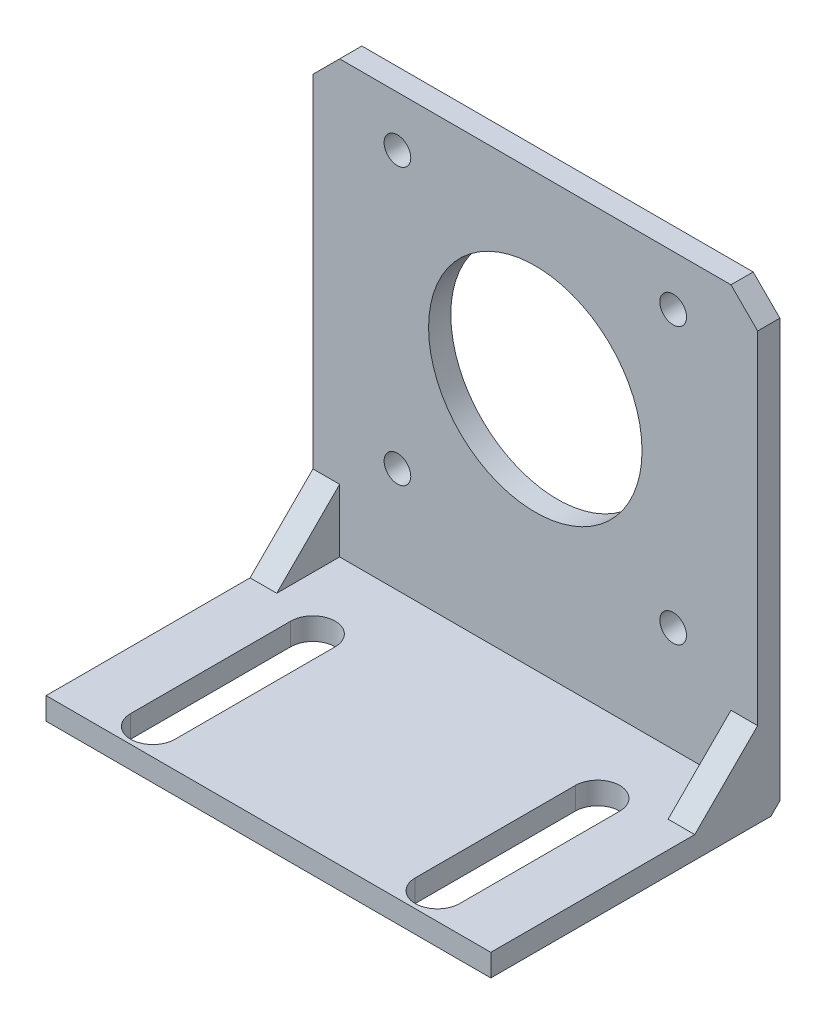
ISO-10303-21;
HEADER;
FILE_DESCRIPTION(('STEP AP214'),'2;1');
FILE_NAME('part.step','',(''),(''),'','','');
FILE_SCHEMA(('AUTOMOTIVE_DESIGN { 1 0 10303 214 1 1 1 1 }'));
ENDSEC;
DATA;
#1=APPLICATION_CONTEXT('core data for automotive mechanical design processes');
#2=APPLICATION_PROTOCOL_DEFINITION('international standard','automotive_design',2000,#1);
#3=PRODUCT_CONTEXT('',#1,'mechanical');
#4=PRODUCT('Part','Part','',(#3));
#5=PRODUCT_RELATED_PRODUCT_CATEGORY('part','',(#4));
#6=PRODUCT_DEFINITION_FORMATION('','',#4);
#7=PRODUCT_DEFINITION_CONTEXT('part definition',#1,'design');
#8=PRODUCT_DEFINITION('design','',#6,#7);
#9=PRODUCT_DEFINITION_SHAPE('','',#8);
#10=(LENGTH_UNIT() NAMED_UNIT(*) SI_UNIT(.MILLI.,.METRE.));
#11=(NAMED_UNIT(*) PLANE_ANGLE_UNIT() SI_UNIT($,.RADIAN.));
#12=(NAMED_UNIT(*) SI_UNIT($,.STERADIAN.) SOLID_ANGLE_UNIT());
#13=UNCERTAINTY_MEASURE_WITH_UNIT(LENGTH_MEASURE(1.E-05),#10,'distance_accuracy_value','');
#14=(GEOMETRIC_REPRESENTATION_CONTEXT(3) GLOBAL_UNCERTAINTY_ASSIGNED_CONTEXT((#13)) GLOBAL_UNIT_ASSIGNED_CONTEXT((#10,
#11,#12)) REPRESENTATION_CONTEXT('',''));
#15=CARTESIAN_POINT('',(0.,0.,0.));
#16=DIRECTION('',(0.,0.,1.));
#17=DIRECTION('',(1.,0.,0.));
#18=AXIS2_PLACEMENT_3D('',#15,#16,#17);
#19=CARTESIAN_POINT('',(0.,0.,2.5));
#20=DIRECTION('',(0.,0.,1.));
#21=DIRECTION('',(1.,0.,0.));
#22=AXIS2_PLACEMENT_3D('',#19,#20,#21);
#23=PLANE('',#22);
#24=CARTESIAN_POINT('',(15.5,-15.5,2.5));
#25=DIRECTION('',(0.,0.,1.));
#26=DIRECTION('',(1.,0.,0.));
#27=AXIS2_PLACEMENT_3D('',#24,#25,#26);
#28=CIRCLE('',#27,1.5);
#29=CARTESIAN_POINT('',(17.,-15.5,2.5));
#30=VERTEX_POINT('',#29);
#31=EDGE_CURVE('E353',#30,#30,#28,.T.);
#32=ORIENTED_EDGE('',*,*,#31,.F.);
#33=EDGE_LOOP('',(#32));
#34=FACE_BOUND('',#33,.T.);
#35=CARTESIAN_POINT('',(15.5,15.5,2.5));
#36=DIRECTION('',(0.,0.,1.));
#37=DIRECTION('',(1.,0.,0.));
#38=AXIS2_PLACEMENT_3D('',#35,#36,#37);
#39=CIRCLE('',#38,1.5);
#40=CARTESIAN_POINT('',(17.,15.5,2.5));
#41=VERTEX_POINT('',#40);
#42=EDGE_CURVE('E357',#41,#41,#39,.F.);
#43=ORIENTED_EDGE('',*,*,#42,.T.);
#44=EDGE_LOOP('',(#43));
#45=FACE_BOUND('',#44,.T.);
#46=CARTESIAN_POINT('',(-15.5,15.5,2.5));
#47=DIRECTION('',(0.,0.,1.));
#48=DIRECTION('',(1.,0.,0.));
#49=AXIS2_PLACEMENT_3D('',#46,#47,#48);
#50=CIRCLE('',#49,1.5);
#51=CARTESIAN_POINT('',(-14.,15.5,2.5));
#52=VERTEX_POINT('',#51);
#53=EDGE_CURVE('E362',#52,#52,#50,.T.);
#54=ORIENTED_EDGE('',*,*,#53,.F.);
#55=EDGE_LOOP('',(#54));
#56=FACE_BOUND('',#55,.T.);
#57=CARTESIAN_POINT('',(0.,0.,2.5));
#58=DIRECTION('',(0.,0.,1.));
#59=DIRECTION('',(1.,0.,0.));
#60=AXIS2_PLACEMENT_3D('',#57,#58,#59);
#61=CIRCLE('',#60,12.);
#62=CARTESIAN_POINT('',(12.,0.,2.5));
#63=VERTEX_POINT('',#62);
#64=EDGE_CURVE('E366',#63,#63,#61,.T.);
#65=ORIENTED_EDGE('',*,*,#64,.F.);
#66=EDGE_LOOP('',(#65));
#67=FACE_BOUND('',#66,.T.);
#68=CARTESIAN_POINT('',(-15.5,-15.5,2.5));
#69=DIRECTION('',(0.,0.,1.));
#70=DIRECTION('',(1.,0.,0.));
#71=AXIS2_PLACEMENT_3D('',#68,#69,#70);
#72=CIRCLE('',#71,1.5);
#73=CARTESIAN_POINT('',(-14.,-15.5,2.5));
#74=VERTEX_POINT('',#73);
#75=EDGE_CURVE('E390',#74,#74,#72,.F.);
#76=ORIENTED_EDGE('',*,*,#75,.T.);
#77=EDGE_LOOP('',(#76));
#78=FACE_BOUND('',#77,.T.);
#79=DIRECTION('',(0.,-1.,0.));
#80=VECTOR('',#79,1.);
#81=CARTESIAN_POINT('',(-25.,0.,2.5));
#82=LINE('',#81,#80);
#83=CARTESIAN_POINT('',(-25.,18.15,2.5));
#84=VERTEX_POINT('',#83);
#85=CARTESIAN_POINT('',(-25.,-20.2789321881346,2.5));
#86=VERTEX_POINT('',#85);
#87=EDGE_CURVE('E386',#84,#86,#82,.T.);
#88=ORIENTED_EDGE('',*,*,#87,.T.);
#89=DIRECTION('',(-1.,0.,0.));
#90=VECTOR('',#89,1.);
#91=CARTESIAN_POINT('',(-22.,-20.2789321881346,2.5));
#92=LINE('',#91,#90);
#93=CARTESIAN_POINT('',(-22.,-20.2789321881346,2.5));
#94=VERTEX_POINT('',#93);
#95=EDGE_CURVE('E202',#94,#86,#92,.T.);
#96=ORIENTED_EDGE('',*,*,#95,.F.);
#97=DIRECTION('',(0.,1.,0.));
#98=VECTOR('',#97,1.);
#99=CARTESIAN_POINT('',(-22.,-27.35,2.5));
#100=LINE('',#99,#98);
#101=CARTESIAN_POINT('',(-22.,-27.35,2.5));
#102=VERTEX_POINT('',#101);
#103=EDGE_CURVE('E188',#102,#94,#100,.T.);
#104=ORIENTED_EDGE('',*,*,#103,.F.);
#105=DIRECTION('',(-1.,0.,0.));
#106=VECTOR('',#105,1.);
#107=CARTESIAN_POINT('',(-25.,-27.35,2.5));
#108=LINE('',#107,#106);
#109=CARTESIAN_POINT('',(22.,-27.35,2.5));
#110=VERTEX_POINT('',#109);
#111=EDGE_CURVE('E207',#110,#102,#108,.T.);
#112=ORIENTED_EDGE('',*,*,#111,.F.);
#113=DIRECTION('',(0.,1.,0.));
#114=VECTOR('',#113,1.);
#115=CARTESIAN_POINT('',(22.,-27.35,2.5));
#116=LINE('',#115,#114);
#117=CARTESIAN_POINT('',(22.,-20.2789321881346,2.5));
#118=VERTEX_POINT('',#117);
#119=EDGE_CURVE('E221',#110,#118,#116,.T.);
#120=ORIENTED_EDGE('',*,*,#119,.T.);
#121=DIRECTION('',(1.,0.,0.));
#122=VECTOR('',#121,1.);
#123=CARTESIAN_POINT('',(22.,-20.2789321881346,2.5));
#124=LINE('',#123,#122);
#125=CARTESIAN_POINT('',(25.,-20.2789321881346,2.5));
#126=VERTEX_POINT('',#125);
#127=EDGE_CURVE('E228',#118,#126,#124,.T.);
#128=ORIENTED_EDGE('',*,*,#127,.T.);
#129=DIRECTION('',(0.,-1.,0.));
#130=VECTOR('',#129,1.);
#131=CARTESIAN_POINT('',(25.,0.,2.5));
#132=LINE('',#131,#130);
#133=CARTESIAN_POINT('',(25.,18.15,2.5));
#134=VERTEX_POINT('',#133);
#135=EDGE_CURVE('E370',#134,#126,#132,.T.);
#136=ORIENTED_EDGE('',*,*,#135,.F.);
#137=DIRECTION('',(-0.707106781186548,0.707106781186548,0.));
#138=VECTOR('',#137,1.);
#139=CARTESIAN_POINT('',(21.575,21.575,2.5));
#140=LINE('',#139,#138);
#141=CARTESIAN_POINT('',(22.,21.15,2.5));
#142=VERTEX_POINT('',#141);
#143=EDGE_CURVE('E374',#134,#142,#140,.T.);
#144=ORIENTED_EDGE('',*,*,#143,.T.);
#145=DIRECTION('',(-1.,0.,0.));
#146=VECTOR('',#145,1.);
#147=CARTESIAN_POINT('',(0.,21.15,2.5));
#148=LINE('',#147,#146);
#149=CARTESIAN_POINT('',(-22.,21.15,2.5));
#150=VERTEX_POINT('',#149);
#151=EDGE_CURVE('E378',#142,#150,#148,.T.);
#152=ORIENTED_EDGE('',*,*,#151,.T.);
#153=DIRECTION('',(-0.707106781186548,-0.707106781186548,0.));
#154=VECTOR('',#153,1.);
#155=CARTESIAN_POINT('',(-21.575,21.575,2.5));
#156=LINE('',#155,#154);
#157=EDGE_CURVE('E382',#150,#84,#156,.T.);
#158=ORIENTED_EDGE('',*,*,#157,.T.);
#159=EDGE_LOOP('',(#88,#96,#104,#112,#120,#128,#136,#144,#152,#158));
#160=FACE_BOUND('',#159,.T.);
#161=ADVANCED_FACE('F41',(#34,#45,#56,#67,#78,#160),#23,.T.);
#162=CARTESIAN_POINT('',(-25.,-27.35,32.5));
#163=DIRECTION('',(0.,-1.,0.));
#164=DIRECTION('',(0.,0.,-1.));
#165=AXIS2_PLACEMENT_3D('',#162,#163,#164);
#166=PLANE('',#165);
#167=DIRECTION('',(0.,0.,1.));
#168=VECTOR('',#167,1.);
#169=CARTESIAN_POINT('',(-18.5,-27.35,0.));
#170=LINE('',#169,#168);
#171=CARTESIAN_POINT('',(-18.5,-27.35,11.5));
#172=VERTEX_POINT('',#171);
#173=CARTESIAN_POINT('',(-18.5,-27.35,29.5));
#174=VERTEX_POINT('',#173);
#175=EDGE_CURVE('E302',#172,#174,#170,.T.);
#176=ORIENTED_EDGE('',*,*,#175,.F.);
#177=CARTESIAN_POINT('',(-16.,-27.35,11.5));
#178=DIRECTION('',(0.,1.,0.));
#179=DIRECTION('',(0.,0.,1.));
#180=AXIS2_PLACEMENT_3D('',#177,#178,#179);
#181=CIRCLE('',#180,2.5);
#182=CARTESIAN_POINT('',(-13.5,-27.35,11.5));
#183=VERTEX_POINT('',#182);
#184=EDGE_CURVE('E236',#183,#172,#181,.T.);
#185=ORIENTED_EDGE('',*,*,#184,.F.);
#186=DIRECTION('',(0.,0.,1.));
#187=VECTOR('',#186,1.);
#188=CARTESIAN_POINT('',(-13.5,-27.35,0.));
#189=LINE('',#188,#187);
#190=CARTESIAN_POINT('',(-13.5,-27.35,29.5));
#191=VERTEX_POINT('',#190);
#192=EDGE_CURVE('E288',#183,#191,#189,.T.);
#193=ORIENTED_EDGE('',*,*,#192,.T.);
#194=CARTESIAN_POINT('',(-16.,-27.35,29.5));
#195=DIRECTION('',(0.,1.,0.));
#196=DIRECTION('',(0.,0.,1.));
#197=AXIS2_PLACEMENT_3D('',#194,#195,#196);
#198=CIRCLE('',#197,2.5);
#199=EDGE_CURVE('E306',#191,#174,#198,.F.);
#200=ORIENTED_EDGE('',*,*,#199,.T.);
#201=EDGE_LOOP('',(#176,#185,#193,#200));
#202=FACE_BOUND('',#201,.T.);
#203=DIRECTION('',(0.,0.,1.));
#204=VECTOR('',#203,1.);
#205=CARTESIAN_POINT('',(18.5,-27.35,0.));
#206=LINE('',#205,#204);
#207=CARTESIAN_POINT('',(18.5,-27.35,11.5));
#208=VERTEX_POINT('',#207);
#209=CARTESIAN_POINT('',(18.5,-27.35,29.5));
#210=VERTEX_POINT('',#209);
#211=EDGE_CURVE('E259',#208,#210,#206,.T.);
#212=ORIENTED_EDGE('',*,*,#211,.T.);
#213=CARTESIAN_POINT('',(16.,-27.35,29.5));
#214=DIRECTION('',(0.,1.,0.));
#215=DIRECTION('',(0.,0.,1.));
#216=AXIS2_PLACEMENT_3D('',#213,#214,#215);
#217=CIRCLE('',#216,2.5);
#218=CARTESIAN_POINT('',(13.5,-27.35,29.5));
#219=VERTEX_POINT('',#218);
#220=EDGE_CURVE('E256',#219,#210,#217,.T.);
#221=ORIENTED_EDGE('',*,*,#220,.F.);
#222=DIRECTION('',(0.,0.,1.));
#223=VECTOR('',#222,1.);
#224=CARTESIAN_POINT('',(13.5,-27.35,0.));
#225=LINE('',#224,#223);
#226=CARTESIAN_POINT('',(13.5,-27.35,11.5));
#227=VERTEX_POINT('',#226);
#228=EDGE_CURVE('E244',#227,#219,#225,.T.);
#229=ORIENTED_EDGE('',*,*,#228,.F.);
#230=CARTESIAN_POINT('',(16.,-27.35,11.5));
#231=DIRECTION('',(0.,1.,0.));
#232=DIRECTION('',(0.,0.,1.));
#233=AXIS2_PLACEMENT_3D('',#230,#231,#232);
#234=CIRCLE('',#233,2.5);
#235=EDGE_CURVE('E264',#208,#227,#234,.T.);
#236=ORIENTED_EDGE('',*,*,#235,.F.);
#237=EDGE_LOOP('',(#212,#221,#229,#236));
#238=FACE_BOUND('',#237,.T.);
#239=DIRECTION('',(-1.,0.,0.));
#240=VECTOR('',#239,1.);
#241=CARTESIAN_POINT('',(-22.,-27.35,9.57106781186551));
#242=LINE('',#241,#240);
#243=CARTESIAN_POINT('',(-22.,-27.35,9.57106781186551));
#244=VERTEX_POINT('',#243);
#245=CARTESIAN_POINT('',(-25.,-27.35,9.57106781186551));
#246=VERTEX_POINT('',#245);
#247=EDGE_CURVE('E194',#244,#246,#242,.T.);
#248=ORIENTED_EDGE('',*,*,#247,.T.);
#249=DIRECTION('',(0.,0.,-1.));
#250=VECTOR('',#249,1.);
#251=CARTESIAN_POINT('',(-25.,-27.35,32.5));
#252=LINE('',#251,#250);
#253=CARTESIAN_POINT('',(-25.,-27.35,32.5));
#254=VERTEX_POINT('',#253);
#255=EDGE_CURVE('E338',#254,#246,#252,.T.);
#256=ORIENTED_EDGE('',*,*,#255,.F.);
#257=DIRECTION('',(-1.,0.,0.));
#258=VECTOR('',#257,1.);
#259=CARTESIAN_POINT('',(-25.,-27.35,32.5));
#260=LINE('',#259,#258);
#261=CARTESIAN_POINT('',(25.,-27.35,32.5));
#262=VERTEX_POINT('',#261);
#263=EDGE_CURVE('E335',#262,#254,#260,.T.);
#264=ORIENTED_EDGE('',*,*,#263,.F.);
#265=DIRECTION('',(0.,0.,-1.));
#266=VECTOR('',#265,1.);
#267=CARTESIAN_POINT('',(25.,-27.35,32.5));
#268=LINE('',#267,#266);
#269=CARTESIAN_POINT('',(25.,-27.35,9.57106781186551));
#270=VERTEX_POINT('',#269);
#271=EDGE_CURVE('E343',#262,#270,#268,.T.);
#272=ORIENTED_EDGE('',*,*,#271,.T.);
#273=DIRECTION('',(1.,0.,0.));
#274=VECTOR('',#273,1.);
#275=CARTESIAN_POINT('',(22.,-27.35,9.57106781186551));
#276=LINE('',#275,#274);
#277=CARTESIAN_POINT('',(22.,-27.35,9.57106781186551));
#278=VERTEX_POINT('',#277);
#279=EDGE_CURVE('E232',#278,#270,#276,.T.);
#280=ORIENTED_EDGE('',*,*,#279,.F.);
#281=DIRECTION('',(0.,0.,-1.));
#282=VECTOR('',#281,1.);
#283=CARTESIAN_POINT('',(22.,-27.35,9.57106781186551));
#284=LINE('',#283,#282);
#285=EDGE_CURVE('E218',#278,#110,#284,.T.);
#286=ORIENTED_EDGE('',*,*,#285,.T.);
#287=ORIENTED_EDGE('',*,*,#111,.T.);
#288=DIRECTION('',(0.,0.,-1.));
#289=VECTOR('',#288,1.);
#290=CARTESIAN_POINT('',(-22.,-27.35,9.57106781186551));
#291=LINE('',#290,#289);
#292=EDGE_CURVE('E186',#244,#102,#291,.T.);
#293=ORIENTED_EDGE('',*,*,#292,.F.);
#294=EDGE_LOOP('',(#248,#256,#264,#272,#280,#286,#287,#293));
#295=FACE_BOUND('',#294,.T.);
#296=ADVANCED_FACE('F205',(#202,#238,#295),#166,.F.);
#297=CARTESIAN_POINT('',(25.,0.,2.5));
#298=DIRECTION('',(1.,0.,0.));
#299=DIRECTION('',(0.,1.,0.));
#300=AXIS2_PLACEMENT_3D('',#297,#298,#299);
#301=PLANE('',#300);
#302=DIRECTION('',(0.,0.,-1.));
#303=VECTOR('',#302,1.);
#304=CARTESIAN_POINT('',(25.,-29.85,2.5));
#305=LINE('',#304,#303);
#306=CARTESIAN_POINT('',(25.,-29.85,32.5));
#307=VERTEX_POINT('',#306);
#308=CARTESIAN_POINT('',(25.,-29.85,0.999999999999994));
#309=VERTEX_POINT('',#308);
#310=EDGE_CURVE('E346',#307,#309,#305,.T.);
#311=ORIENTED_EDGE('',*,*,#310,.T.);
#312=DIRECTION('',(0.,0.707106781186546,-0.707106781186549));
#313=VECTOR('',#312,1.);
#314=CARTESIAN_POINT('',(25.,-15.6750000000001,-13.175));
#315=LINE('',#314,#313);
#316=CARTESIAN_POINT('',(25.,-28.85,0.));
#317=VERTEX_POINT('',#316);
#318=EDGE_CURVE('E11',#309,#317,#315,.T.);
#319=ORIENTED_EDGE('',*,*,#318,.T.);
#320=DIRECTION('',(0.,-1.,0.));
#321=VECTOR('',#320,1.);
#322=CARTESIAN_POINT('',(25.,0.,0.));
#323=LINE('',#322,#321);
#324=CARTESIAN_POINT('',(25.,18.15,0.));
#325=VERTEX_POINT('',#324);
#326=EDGE_CURVE('E410',#325,#317,#323,.T.);
#327=ORIENTED_EDGE('',*,*,#326,.F.);
#328=DIRECTION('',(0.,0.,-1.));
#329=VECTOR('',#328,1.);
#330=CARTESIAN_POINT('',(25.,18.15,2.5));
#331=LINE('',#330,#329);
#332=EDGE_CURVE('E443',#134,#325,#331,.T.);
#333=ORIENTED_EDGE('',*,*,#332,.F.);
#334=ORIENTED_EDGE('',*,*,#135,.T.);
#335=DIRECTION('',(0.,-0.707106781186544,0.707106781186551));
#336=VECTOR('',#335,1.);
#337=CARTESIAN_POINT('',(25.,-20.2789321881346,2.5));
#338=LINE('',#337,#336);
#339=EDGE_CURVE('E216',#126,#270,#338,.T.);
#340=ORIENTED_EDGE('',*,*,#339,.T.);
#341=ORIENTED_EDGE('',*,*,#271,.F.);
#342=DIRECTION('',(0.,1.,0.));
#343=VECTOR('',#342,1.);
#344=CARTESIAN_POINT('',(25.,-29.85,32.5));
#345=LINE('',#344,#343);
#346=EDGE_CURVE('E332',#307,#262,#345,.T.);
#347=ORIENTED_EDGE('',*,*,#346,.F.);
#348=EDGE_LOOP('',(#311,#319,#327,#333,#334,#340,#341,#347));
#349=FACE_BOUND('',#348,.T.);
#350=ADVANCED_FACE('F473',(#349),#301,.T.);
#351=CARTESIAN_POINT('',(21.575,21.575,2.5));
#352=DIRECTION('',(-0.707106781186548,-0.707106781186548,0.));
#353=DIRECTION('',(0.707106781186548,-0.707106781186548,0.));
#354=AXIS2_PLACEMENT_3D('',#351,#352,#353);
#355=PLANE('',#354);
#356=DIRECTION('',(-0.707106781186548,0.707106781186548,0.));
#357=VECTOR('',#356,1.);
#358=CARTESIAN_POINT('',(21.575,21.575,0.));
#359=LINE('',#358,#357);
#360=CARTESIAN_POINT('',(22.,21.15,0.));
#361=VERTEX_POINT('',#360);
#362=EDGE_CURVE('E414',#325,#361,#359,.T.);
#363=ORIENTED_EDGE('',*,*,#362,.T.);
#364=DIRECTION('',(0.,0.,-1.));
#365=VECTOR('',#364,1.);
#366=CARTESIAN_POINT('',(22.,21.15,2.5));
#367=LINE('',#366,#365);
#368=EDGE_CURVE('E439',#142,#361,#367,.T.);
#369=ORIENTED_EDGE('',*,*,#368,.F.);
#370=ORIENTED_EDGE('',*,*,#143,.F.);
#371=ORIENTED_EDGE('',*,*,#332,.T.);
#372=EDGE_LOOP('',(#363,#369,#370,#371));
#373=FACE_BOUND('',#372,.T.);
#374=ADVANCED_FACE('F470',(#373),#355,.F.);
#375=CARTESIAN_POINT('',(0.,21.15,2.5));
#376=DIRECTION('',(0.,-1.,0.));
#377=DIRECTION('',(1.,0.,0.));
#378=AXIS2_PLACEMENT_3D('',#375,#376,#377);
#379=PLANE('',#378);
#380=DIRECTION('',(-1.,0.,0.));
#381=VECTOR('',#380,1.);
#382=CARTESIAN_POINT('',(0.,21.15,0.));
#383=LINE('',#382,#381);
#384=CARTESIAN_POINT('',(-22.,21.15,0.));
#385=VERTEX_POINT('',#384);
#386=EDGE_CURVE('E418',#361,#385,#383,.T.);
#387=ORIENTED_EDGE('',*,*,#386,.T.);
#388=DIRECTION('',(0.,0.,-1.));
#389=VECTOR('',#388,1.);
#390=CARTESIAN_POINT('',(-22.,21.15,2.5));
#391=LINE('',#390,#389);
#392=EDGE_CURVE('E435',#150,#385,#391,.T.);
#393=ORIENTED_EDGE('',*,*,#392,.F.);
#394=ORIENTED_EDGE('',*,*,#151,.F.);
#395=ORIENTED_EDGE('',*,*,#368,.T.);
#396=EDGE_LOOP('',(#387,#393,#394,#395));
#397=FACE_BOUND('',#396,.T.);
#398=ADVANCED_FACE('F467',(#397),#379,.F.);
#399=CARTESIAN_POINT('',(-21.575,21.575,2.5));
#400=DIRECTION('',(0.707106781186548,-0.707106781186548,0.));
#401=DIRECTION('',(0.707106781186548,0.707106781186548,0.));
#402=AXIS2_PLACEMENT_3D('',#399,#400,#401);
#403=PLANE('',#402);
#404=DIRECTION('',(-0.707106781186548,-0.707106781186548,0.));
#405=VECTOR('',#404,1.);
#406=CARTESIAN_POINT('',(-21.575,21.575,0.));
#407=LINE('',#406,#405);
#408=CARTESIAN_POINT('',(-25.,18.15,0.));
#409=VERTEX_POINT('',#408);
#410=EDGE_CURVE('E422',#385,#409,#407,.T.);
#411=ORIENTED_EDGE('',*,*,#410,.T.);
#412=DIRECTION('',(0.,0.,-1.));
#413=VECTOR('',#412,1.);
#414=CARTESIAN_POINT('',(-25.,18.15,2.5));
#415=LINE('',#414,#413);
#416=EDGE_CURVE('E394',#84,#409,#415,.T.);
#417=ORIENTED_EDGE('',*,*,#416,.F.);
#418=ORIENTED_EDGE('',*,*,#157,.F.);
#419=ORIENTED_EDGE('',*,*,#392,.T.);
#420=EDGE_LOOP('',(#411,#417,#418,#419));
#421=FACE_BOUND('',#420,.T.);
#422=ADVANCED_FACE('F463',(#421),#403,.F.);
#423=CARTESIAN_POINT('',(-25.,0.,2.5));
#424=DIRECTION('',(1.,0.,0.));
#425=DIRECTION('',(0.,1.,0.));
#426=AXIS2_PLACEMENT_3D('',#423,#424,#425);
#427=PLANE('',#426);
#428=DIRECTION('',(0.,-1.,0.));
#429=VECTOR('',#428,1.);
#430=CARTESIAN_POINT('',(-25.,0.,0.));
#431=LINE('',#430,#429);
#432=CARTESIAN_POINT('',(-25.,-28.85,0.));
#433=VERTEX_POINT('',#432);
#434=EDGE_CURVE('E426',#409,#433,#431,.T.);
#435=ORIENTED_EDGE('',*,*,#434,.T.);
#436=DIRECTION('',(0.,-0.707106781186546,0.707106781186549));
#437=VECTOR('',#436,1.);
#438=CARTESIAN_POINT('',(-25.,-28.85,0.));
#439=LINE('',#438,#437);
#440=CARTESIAN_POINT('',(-25.,-29.85,0.999999999999994));
#441=VERTEX_POINT('',#440);
#442=EDGE_CURVE('E64',#433,#441,#439,.T.);
#443=ORIENTED_EDGE('',*,*,#442,.T.);
#444=DIRECTION('',(0.,0.,-1.));
#445=VECTOR('',#444,1.);
#446=CARTESIAN_POINT('',(-25.,-29.85,2.5));
#447=LINE('',#446,#445);
#448=CARTESIAN_POINT('',(-25.,-29.85,32.5));
#449=VERTEX_POINT('',#448);
#450=EDGE_CURVE('E347',#449,#441,#447,.T.);
#451=ORIENTED_EDGE('',*,*,#450,.F.);
#452=DIRECTION('',(0.,-1.,0.));
#453=VECTOR('',#452,1.);
#454=CARTESIAN_POINT('',(-25.,-29.85,32.5));
#455=LINE('',#454,#453);
#456=EDGE_CURVE('E324',#254,#449,#455,.T.);
#457=ORIENTED_EDGE('',*,*,#456,.F.);
#458=ORIENTED_EDGE('',*,*,#255,.T.);
#459=DIRECTION('',(0.,-0.707106781186544,0.707106781186551));
#460=VECTOR('',#459,1.);
#461=CARTESIAN_POINT('',(-25.,-20.2789321881346,2.5));
#462=LINE('',#461,#460);
#463=EDGE_CURVE('E197',#86,#246,#462,.T.);
#464=ORIENTED_EDGE('',*,*,#463,.F.);
#465=ORIENTED_EDGE('',*,*,#87,.F.);
#466=ORIENTED_EDGE('',*,*,#416,.T.);
#467=EDGE_LOOP('',(#435,#443,#451,#457,#458,#464,#465,#466));
#468=FACE_BOUND('',#467,.T.);
#469=ADVANCED_FACE('F460',(#468),#427,.F.);
#470=CARTESIAN_POINT('',(0.,0.,2.5));
#471=DIRECTION('',(0.,0.,-1.));
#472=DIRECTION('',(-1.,0.,0.));
#473=AXIS2_PLACEMENT_3D('',#470,#471,#472);
#474=CYLINDRICAL_SURFACE('',#473,12.);
#475=ORIENTED_EDGE('',*,*,#64,.T.);
#476=EDGE_LOOP('',(#475));
#477=FACE_BOUND('',#476,.T.);
#478=CARTESIAN_POINT('',(0.,0.,0.));
#479=DIRECTION('',(0.,0.,1.));
#480=DIRECTION('',(1.,0.,0.));
#481=AXIS2_PLACEMENT_3D('',#478,#479,#480);
#482=CIRCLE('',#481,12.);
#483=CARTESIAN_POINT('',(12.,0.,0.));
#484=VERTEX_POINT('',#483);
#485=EDGE_CURVE('E406',#484,#484,#482,.T.);
#486=ORIENTED_EDGE('',*,*,#485,.F.);
#487=EDGE_LOOP('',(#486));
#488=FACE_BOUND('',#487,.T.);
#489=ADVANCED_FACE('F504',(#477,#488),#474,.F.);
#490=CARTESIAN_POINT('',(-15.5,15.5,2.5));
#491=DIRECTION('',(0.,0.,-1.));
#492=DIRECTION('',(-1.,0.,0.));
#493=AXIS2_PLACEMENT_3D('',#490,#491,#492);
#494=CYLINDRICAL_SURFACE('',#493,1.5);
#495=ORIENTED_EDGE('',*,*,#53,.T.);
#496=EDGE_LOOP('',(#495));
#497=FACE_BOUND('',#496,.T.);
#498=CARTESIAN_POINT('',(-15.5,15.5,0.));
#499=DIRECTION('',(0.,0.,1.));
#500=DIRECTION('',(1.,0.,0.));
#501=AXIS2_PLACEMENT_3D('',#498,#499,#500);
#502=CIRCLE('',#501,1.5);
#503=CARTESIAN_POINT('',(-14.,15.5,0.));
#504=VERTEX_POINT('',#503);
#505=EDGE_CURVE('E402',#504,#504,#502,.T.);
#506=ORIENTED_EDGE('',*,*,#505,.F.);
#507=EDGE_LOOP('',(#506));
#508=FACE_BOUND('',#507,.T.);
#509=ADVANCED_FACE('F515',(#497,#508),#494,.F.);
#510=CARTESIAN_POINT('',(15.5,15.5,2.5));
#511=DIRECTION('',(0.,0.,-1.));
#512=DIRECTION('',(-1.,0.,0.));
#513=AXIS2_PLACEMENT_3D('',#510,#511,#512);
#514=CYLINDRICAL_SURFACE('',#513,1.5);
#515=ORIENTED_EDGE('',*,*,#42,.F.);
#516=EDGE_LOOP('',(#515));
#517=FACE_BOUND('',#516,.T.);
#518=CARTESIAN_POINT('',(15.5,15.5,0.));
#519=DIRECTION('',(0.,0.,1.));
#520=DIRECTION('',(1.,0.,0.));
#521=AXIS2_PLACEMENT_3D('',#518,#519,#520);
#522=CIRCLE('',#521,1.5);
#523=CARTESIAN_POINT('',(17.,15.5,0.));
#524=VERTEX_POINT('',#523);
#525=EDGE_CURVE('E398',#524,#524,#522,.F.);
#526=ORIENTED_EDGE('',*,*,#525,.T.);
#527=EDGE_LOOP('',(#526));
#528=FACE_BOUND('',#527,.T.);
#529=ADVANCED_FACE('F519',(#517,#528),#514,.F.);
#530=CARTESIAN_POINT('',(15.5,-15.5,2.5));
#531=DIRECTION('',(0.,0.,-1.));
#532=DIRECTION('',(-1.,0.,0.));
#533=AXIS2_PLACEMENT_3D('',#530,#531,#532);
#534=CYLINDRICAL_SURFACE('',#533,1.5);
#535=ORIENTED_EDGE('',*,*,#31,.T.);
#536=EDGE_LOOP('',(#535));
#537=FACE_BOUND('',#536,.T.);
#538=CARTESIAN_POINT('',(15.5,-15.5,0.));
#539=DIRECTION('',(0.,0.,1.));
#540=DIRECTION('',(1.,0.,0.));
#541=AXIS2_PLACEMENT_3D('',#538,#539,#540);
#542=CIRCLE('',#541,1.5);
#543=CARTESIAN_POINT('',(17.,-15.5,0.));
#544=VERTEX_POINT('',#543);
#545=EDGE_CURVE('E350',#544,#544,#542,.T.);
#546=ORIENTED_EDGE('',*,*,#545,.F.);
#547=EDGE_LOOP('',(#546));
#548=FACE_BOUND('',#547,.T.);
#549=ADVANCED_FACE('F500',(#537,#548),#534,.F.);
#550=CARTESIAN_POINT('',(-15.5,-15.5,2.5));
#551=DIRECTION('',(0.,0.,-1.));
#552=DIRECTION('',(-1.,0.,0.));
#553=AXIS2_PLACEMENT_3D('',#550,#551,#552);
#554=CYLINDRICAL_SURFACE('',#553,1.5);
#555=ORIENTED_EDGE('',*,*,#75,.F.);
#556=EDGE_LOOP('',(#555));
#557=FACE_BOUND('',#556,.T.);
#558=CARTESIAN_POINT('',(-15.5,-15.5,0.));
#559=DIRECTION('',(0.,0.,1.));
#560=DIRECTION('',(1.,0.,0.));
#561=AXIS2_PLACEMENT_3D('',#558,#559,#560);
#562=CIRCLE('',#561,1.5);
#563=CARTESIAN_POINT('',(-14.,-15.5,0.));
#564=VERTEX_POINT('',#563);
#565=EDGE_CURVE('E358',#564,#564,#562,.F.);
#566=ORIENTED_EDGE('',*,*,#565,.T.);
#567=EDGE_LOOP('',(#566));
#568=FACE_BOUND('',#567,.T.);
#569=ADVANCED_FACE('F496',(#557,#568),#554,.F.);
#570=CARTESIAN_POINT('',(0.,0.,0.));
#571=DIRECTION('',(0.,0.,1.));
#572=DIRECTION('',(1.,0.,0.));
#573=AXIS2_PLACEMENT_3D('',#570,#571,#572);
#574=PLANE('',#573);
#575=ORIENTED_EDGE('',*,*,#545,.T.);
#576=EDGE_LOOP('',(#575));
#577=FACE_BOUND('',#576,.T.);
#578=ORIENTED_EDGE('',*,*,#525,.F.);
#579=EDGE_LOOP('',(#578));
#580=FACE_BOUND('',#579,.T.);
#581=ORIENTED_EDGE('',*,*,#505,.T.);
#582=EDGE_LOOP('',(#581));
#583=FACE_BOUND('',#582,.T.);
#584=ORIENTED_EDGE('',*,*,#485,.T.);
#585=EDGE_LOOP('',(#584));
#586=FACE_BOUND('',#585,.T.);
#587=ORIENTED_EDGE('',*,*,#326,.T.);
#588=DIRECTION('',(-1.,0.,0.));
#589=VECTOR('',#588,1.);
#590=CARTESIAN_POINT('',(-25.,-28.85,0.));
#591=LINE('',#590,#589);
#592=EDGE_CURVE('E446',#317,#433,#591,.T.);
#593=ORIENTED_EDGE('',*,*,#592,.T.);
#594=ORIENTED_EDGE('',*,*,#434,.F.);
#595=ORIENTED_EDGE('',*,*,#410,.F.);
#596=ORIENTED_EDGE('',*,*,#386,.F.);
#597=ORIENTED_EDGE('',*,*,#362,.F.);
#598=EDGE_LOOP('',(#587,#593,#594,#595,#596,#597));
#599=FACE_BOUND('',#598,.T.);
#600=ORIENTED_EDGE('',*,*,#565,.F.);
#601=EDGE_LOOP('',(#600));
#602=FACE_BOUND('',#601,.T.);
#603=ADVANCED_FACE('F454',(#577,#580,#583,#586,#599,#602),#574,.F.);
#604=CARTESIAN_POINT('',(25.,-29.85,2.5));
#605=DIRECTION('',(0.,-1.,0.));
#606=DIRECTION('',(1.,0.,0.));
#607=AXIS2_PLACEMENT_3D('',#604,#605,#606);
#608=PLANE('',#607);
#609=CARTESIAN_POINT('',(16.,-29.85,29.5));
#610=DIRECTION('',(0.,1.,0.));
#611=DIRECTION('',(0.,0.,1.));
#612=AXIS2_PLACEMENT_3D('',#609,#610,#611);
#613=CIRCLE('',#612,2.5);
#614=CARTESIAN_POINT('',(13.5,-29.85,29.5));
#615=VERTEX_POINT('',#614);
#616=CARTESIAN_POINT('',(18.5,-29.85,29.5));
#617=VERTEX_POINT('',#616);
#618=EDGE_CURVE('E239',#615,#617,#613,.T.);
#619=ORIENTED_EDGE('',*,*,#618,.T.);
#620=DIRECTION('',(0.,0.,1.));
#621=VECTOR('',#620,1.);
#622=CARTESIAN_POINT('',(18.5,-29.85,0.));
#623=LINE('',#622,#621);
#624=CARTESIAN_POINT('',(18.5,-29.85,11.5));
#625=VERTEX_POINT('',#624);
#626=EDGE_CURVE('E243',#625,#617,#623,.T.);
#627=ORIENTED_EDGE('',*,*,#626,.F.);
#628=CARTESIAN_POINT('',(16.,-29.85,11.5));
#629=DIRECTION('',(0.,1.,0.));
#630=DIRECTION('',(0.,0.,1.));
#631=AXIS2_PLACEMENT_3D('',#628,#629,#630);
#632=CIRCLE('',#631,2.5);
#633=CARTESIAN_POINT('',(13.5,-29.85,11.5));
#634=VERTEX_POINT('',#633);
#635=EDGE_CURVE('E247',#625,#634,#632,.T.);
#636=ORIENTED_EDGE('',*,*,#635,.T.);
#637=DIRECTION('',(0.,0.,1.));
#638=VECTOR('',#637,1.);
#639=CARTESIAN_POINT('',(13.5,-29.85,0.));
#640=LINE('',#639,#638);
#641=EDGE_CURVE('E251',#634,#615,#640,.T.);
#642=ORIENTED_EDGE('',*,*,#641,.T.);
#643=EDGE_LOOP('',(#619,#627,#636,#642));
#644=FACE_BOUND('',#643,.T.);
#645=CARTESIAN_POINT('',(-16.,-29.85,11.5));
#646=DIRECTION('',(0.,1.,0.));
#647=DIRECTION('',(0.,0.,1.));
#648=AXIS2_PLACEMENT_3D('',#645,#646,#647);
#649=CIRCLE('',#648,2.5);
#650=CARTESIAN_POINT('',(-13.5,-29.85,11.5));
#651=VERTEX_POINT('',#650);
#652=CARTESIAN_POINT('',(-18.5,-29.85,11.5));
#653=VERTEX_POINT('',#652);
#654=EDGE_CURVE('E283',#651,#653,#649,.T.);
#655=ORIENTED_EDGE('',*,*,#654,.T.);
#656=DIRECTION('',(0.,0.,1.));
#657=VECTOR('',#656,1.);
#658=CARTESIAN_POINT('',(-18.5,-29.85,0.));
#659=LINE('',#658,#657);
#660=CARTESIAN_POINT('',(-18.5,-29.85,29.5));
#661=VERTEX_POINT('',#660);
#662=EDGE_CURVE('E287',#653,#661,#659,.T.);
#663=ORIENTED_EDGE('',*,*,#662,.T.);
#664=CARTESIAN_POINT('',(-16.,-29.85,29.5));
#665=DIRECTION('',(0.,1.,0.));
#666=DIRECTION('',(0.,0.,1.));
#667=AXIS2_PLACEMENT_3D('',#664,#665,#666);
#668=CIRCLE('',#667,2.5);
#669=CARTESIAN_POINT('',(-13.5,-29.85,29.5));
#670=VERTEX_POINT('',#669);
#671=EDGE_CURVE('E292',#670,#661,#668,.F.);
#672=ORIENTED_EDGE('',*,*,#671,.F.);
#673=DIRECTION('',(0.,0.,1.));
#674=VECTOR('',#673,1.);
#675=CARTESIAN_POINT('',(-13.5,-29.85,0.));
#676=LINE('',#675,#674);
#677=EDGE_CURVE('E296',#651,#670,#676,.T.);
#678=ORIENTED_EDGE('',*,*,#677,.F.);
#679=EDGE_LOOP('',(#655,#663,#672,#678));
#680=FACE_BOUND('',#679,.T.);
#681=ORIENTED_EDGE('',*,*,#450,.T.);
#682=DIRECTION('',(1.,0.,0.));
#683=VECTOR('',#682,1.);
#684=CARTESIAN_POINT('',(25.,-29.85,0.999999999999994));
#685=LINE('',#684,#683);
#686=EDGE_CURVE('E50',#441,#309,#685,.T.);
#687=ORIENTED_EDGE('',*,*,#686,.T.);
#688=ORIENTED_EDGE('',*,*,#310,.F.);
#689=DIRECTION('',(1.,0.,0.));
#690=VECTOR('',#689,1.);
#691=CARTESIAN_POINT('',(-25.,-29.85,32.5));
#692=LINE('',#691,#690);
#693=EDGE_CURVE('E328',#449,#307,#692,.T.);
#694=ORIENTED_EDGE('',*,*,#693,.F.);
#695=EDGE_LOOP('',(#681,#687,#688,#694));
#696=FACE_BOUND('',#695,.T.);
#697=ADVANCED_FACE('F493',(#644,#680,#696),#608,.T.);
#698=CARTESIAN_POINT('',(0.,0.,32.5));
#699=DIRECTION('',(0.,0.,-1.));
#700=DIRECTION('',(-1.,0.,0.));
#701=AXIS2_PLACEMENT_3D('',#698,#699,#700);
#702=PLANE('',#701);
#703=ORIENTED_EDGE('',*,*,#456,.T.);
#704=ORIENTED_EDGE('',*,*,#693,.T.);
#705=ORIENTED_EDGE('',*,*,#346,.T.);
#706=ORIENTED_EDGE('',*,*,#263,.T.);
#707=EDGE_LOOP('',(#703,#704,#705,#706));
#708=FACE_BOUND('',#707,.T.);
#709=ADVANCED_FACE('F556',(#708),#702,.F.);
#710=CARTESIAN_POINT('',(-16.,-29.85,11.5));
#711=DIRECTION('',(0.,1.,0.));
#712=DIRECTION('',(0.,0.,1.));
#713=AXIS2_PLACEMENT_3D('',#710,#711,#712);
#714=CYLINDRICAL_SURFACE('',#713,2.5);
#715=ORIENTED_EDGE('',*,*,#184,.T.);
#716=DIRECTION('',(0.,1.,0.));
#717=VECTOR('',#716,1.);
#718=CARTESIAN_POINT('',(-18.5,-29.85,11.5));
#719=LINE('',#718,#717);
#720=EDGE_CURVE('E299',#653,#172,#719,.T.);
#721=ORIENTED_EDGE('',*,*,#720,.F.);
#722=ORIENTED_EDGE('',*,*,#654,.F.);
#723=DIRECTION('',(0.,1.,0.));
#724=VECTOR('',#723,1.);
#725=CARTESIAN_POINT('',(-13.5,-29.85,11.5));
#726=LINE('',#725,#724);
#727=EDGE_CURVE('E260',#651,#183,#726,.T.);
#728=ORIENTED_EDGE('',*,*,#727,.T.);
#729=EDGE_LOOP('',(#715,#721,#722,#728));
#730=FACE_BOUND('',#729,.T.);
#731=ADVANCED_FACE('F562',(#730),#714,.F.);
#732=CARTESIAN_POINT('',(-13.5,-29.85,0.));
#733=DIRECTION('',(-1.,0.,0.));
#734=DIRECTION('',(0.,0.,1.));
#735=AXIS2_PLACEMENT_3D('',#732,#733,#734);
#736=PLANE('',#735);
#737=ORIENTED_EDGE('',*,*,#192,.F.);
#738=ORIENTED_EDGE('',*,*,#727,.F.);
#739=ORIENTED_EDGE('',*,*,#677,.T.);
#740=DIRECTION('',(0.,1.,0.));
#741=VECTOR('',#740,1.);
#742=CARTESIAN_POINT('',(-13.5,-29.85,29.5));
#743=LINE('',#742,#741);
#744=EDGE_CURVE('E315',#670,#191,#743,.T.);
#745=ORIENTED_EDGE('',*,*,#744,.T.);
#746=EDGE_LOOP('',(#737,#738,#739,#745));
#747=FACE_BOUND('',#746,.T.);
#748=ADVANCED_FACE('F570',(#747),#736,.T.);
#749=CARTESIAN_POINT('',(-16.,-29.85,29.5));
#750=DIRECTION('',(0.,1.,0.));
#751=DIRECTION('',(0.,0.,1.));
#752=AXIS2_PLACEMENT_3D('',#749,#750,#751);
#753=CYLINDRICAL_SURFACE('',#752,2.5);
#754=ORIENTED_EDGE('',*,*,#199,.F.);
#755=ORIENTED_EDGE('',*,*,#744,.F.);
#756=ORIENTED_EDGE('',*,*,#671,.T.);
#757=DIRECTION('',(0.,1.,0.));
#758=VECTOR('',#757,1.);
#759=CARTESIAN_POINT('',(-18.5,-29.85,29.5));
#760=LINE('',#759,#758);
#761=EDGE_CURVE('E318',#661,#174,#760,.T.);
#762=ORIENTED_EDGE('',*,*,#761,.T.);
#763=EDGE_LOOP('',(#754,#755,#756,#762));
#764=FACE_BOUND('',#763,.T.);
#765=ADVANCED_FACE('F578',(#764),#753,.F.);
#766=CARTESIAN_POINT('',(-18.5,-29.85,0.));
#767=DIRECTION('',(-1.,0.,0.));
#768=DIRECTION('',(0.,0.,1.));
#769=AXIS2_PLACEMENT_3D('',#766,#767,#768);
#770=PLANE('',#769);
#771=ORIENTED_EDGE('',*,*,#175,.T.);
#772=ORIENTED_EDGE('',*,*,#761,.F.);
#773=ORIENTED_EDGE('',*,*,#662,.F.);
#774=ORIENTED_EDGE('',*,*,#720,.T.);
#775=EDGE_LOOP('',(#771,#772,#773,#774));
#776=FACE_BOUND('',#775,.T.);
#777=ADVANCED_FACE('F586',(#776),#770,.F.);
#778=CARTESIAN_POINT('',(16.,-29.85,29.5));
#779=DIRECTION('',(0.,1.,0.));
#780=DIRECTION('',(0.,0.,1.));
#781=AXIS2_PLACEMENT_3D('',#778,#779,#780);
#782=CYLINDRICAL_SURFACE('',#781,2.5);
#783=ORIENTED_EDGE('',*,*,#220,.T.);
#784=DIRECTION('',(0.,1.,0.));
#785=VECTOR('',#784,1.);
#786=CARTESIAN_POINT('',(18.5,-29.85,29.5));
#787=LINE('',#786,#785);
#788=EDGE_CURVE('E255',#617,#210,#787,.T.);
#789=ORIENTED_EDGE('',*,*,#788,.F.);
#790=ORIENTED_EDGE('',*,*,#618,.F.);
#791=DIRECTION('',(0.,1.,0.));
#792=VECTOR('',#791,1.);
#793=CARTESIAN_POINT('',(13.5,-29.85,29.5));
#794=LINE('',#793,#792);
#795=EDGE_CURVE('E271',#615,#219,#794,.T.);
#796=ORIENTED_EDGE('',*,*,#795,.T.);
#797=EDGE_LOOP('',(#783,#789,#790,#796));
#798=FACE_BOUND('',#797,.T.);
#799=ADVANCED_FACE('F594',(#798),#782,.F.);
#800=CARTESIAN_POINT('',(13.5,-29.85,0.));
#801=DIRECTION('',(-1.,0.,0.));
#802=DIRECTION('',(0.,0.,1.));
#803=AXIS2_PLACEMENT_3D('',#800,#801,#802);
#804=PLANE('',#803);
#805=ORIENTED_EDGE('',*,*,#228,.T.);
#806=ORIENTED_EDGE('',*,*,#795,.F.);
#807=ORIENTED_EDGE('',*,*,#641,.F.);
#808=DIRECTION('',(0.,1.,0.));
#809=VECTOR('',#808,1.);
#810=CARTESIAN_POINT('',(13.5,-29.85,11.5));
#811=LINE('',#810,#809);
#812=EDGE_CURVE('E274',#634,#227,#811,.T.);
#813=ORIENTED_EDGE('',*,*,#812,.T.);
#814=EDGE_LOOP('',(#805,#806,#807,#813));
#815=FACE_BOUND('',#814,.T.);
#816=ADVANCED_FACE('F602',(#815),#804,.F.);
#817=CARTESIAN_POINT('',(16.,-29.85,11.5));
#818=DIRECTION('',(0.,1.,0.));
#819=DIRECTION('',(0.,0.,1.));
#820=AXIS2_PLACEMENT_3D('',#817,#818,#819);
#821=CYLINDRICAL_SURFACE('',#820,2.5);
#822=ORIENTED_EDGE('',*,*,#235,.T.);
#823=ORIENTED_EDGE('',*,*,#812,.F.);
#824=ORIENTED_EDGE('',*,*,#635,.F.);
#825=DIRECTION('',(0.,1.,0.));
#826=VECTOR('',#825,1.);
#827=CARTESIAN_POINT('',(18.5,-29.85,11.5));
#828=LINE('',#827,#826);
#829=EDGE_CURVE('E277',#625,#208,#828,.T.);
#830=ORIENTED_EDGE('',*,*,#829,.T.);
#831=EDGE_LOOP('',(#822,#823,#824,#830));
#832=FACE_BOUND('',#831,.T.);
#833=ADVANCED_FACE('F610',(#832),#821,.F.);
#834=CARTESIAN_POINT('',(18.5,-29.85,0.));
#835=DIRECTION('',(-1.,0.,0.));
#836=DIRECTION('',(0.,0.,1.));
#837=AXIS2_PLACEMENT_3D('',#834,#835,#836);
#838=PLANE('',#837);
#839=ORIENTED_EDGE('',*,*,#211,.F.);
#840=ORIENTED_EDGE('',*,*,#829,.F.);
#841=ORIENTED_EDGE('',*,*,#626,.T.);
#842=ORIENTED_EDGE('',*,*,#788,.T.);
#843=EDGE_LOOP('',(#839,#840,#841,#842));
#844=FACE_BOUND('',#843,.T.);
#845=ADVANCED_FACE('F618',(#844),#838,.T.);
#846=CARTESIAN_POINT('',(22.,-20.2789321881346,2.5));
#847=DIRECTION('',(0.,0.707106781186551,0.707106781186544));
#848=DIRECTION('',(0.,-0.707106781186544,0.707106781186551));
#849=AXIS2_PLACEMENT_3D('',#846,#847,#848);
#850=PLANE('',#849);
#851=ORIENTED_EDGE('',*,*,#339,.F.);
#852=ORIENTED_EDGE('',*,*,#127,.F.);
#853=DIRECTION('',(0.,-0.707106781186544,0.707106781186551));
#854=VECTOR('',#853,1.);
#855=CARTESIAN_POINT('',(22.,-20.2789321881346,2.5));
#856=LINE('',#855,#854);
#857=EDGE_CURVE('E224',#118,#278,#856,.T.);
#858=ORIENTED_EDGE('',*,*,#857,.T.);
#859=ORIENTED_EDGE('',*,*,#279,.T.);
#860=EDGE_LOOP('',(#851,#852,#858,#859));
#861=FACE_BOUND('',#860,.T.);
#862=ADVANCED_FACE('F626',(#861),#850,.T.);
#863=CARTESIAN_POINT('',(22.,0.,0.));
#864=DIRECTION('',(1.,0.,0.));
#865=DIRECTION('',(0.,1.,0.));
#866=AXIS2_PLACEMENT_3D('',#863,#864,#865);
#867=PLANE('',#866);
#868=ORIENTED_EDGE('',*,*,#285,.F.);
#869=ORIENTED_EDGE('',*,*,#857,.F.);
#870=ORIENTED_EDGE('',*,*,#119,.F.);
#871=EDGE_LOOP('',(#868,#869,#870));
#872=FACE_BOUND('',#871,.T.);
#873=ADVANCED_FACE('F634',(#872),#867,.F.);
#874=CARTESIAN_POINT('',(-22.,-20.2789321881346,2.5));
#875=DIRECTION('',(0.,-0.707106781186551,-0.707106781186544));
#876=DIRECTION('',(0.,0.707106781186544,-0.707106781186551));
#877=AXIS2_PLACEMENT_3D('',#874,#875,#876);
#878=PLANE('',#877);
#879=ORIENTED_EDGE('',*,*,#463,.T.);
#880=ORIENTED_EDGE('',*,*,#247,.F.);
#881=DIRECTION('',(0.,-0.707106781186544,0.707106781186551));
#882=VECTOR('',#881,1.);
#883=CARTESIAN_POINT('',(-22.,-20.2789321881346,2.5));
#884=LINE('',#883,#882);
#885=EDGE_CURVE('E182',#94,#244,#884,.T.);
#886=ORIENTED_EDGE('',*,*,#885,.F.);
#887=ORIENTED_EDGE('',*,*,#95,.T.);
#888=EDGE_LOOP('',(#879,#880,#886,#887));
#889=FACE_BOUND('',#888,.T.);
#890=ADVANCED_FACE('F195',(#889),#878,.F.);
#891=CARTESIAN_POINT('',(-22.,0.,0.));
#892=DIRECTION('',(-1.,0.,0.));
#893=DIRECTION('',(0.,1.,0.));
#894=AXIS2_PLACEMENT_3D('',#891,#892,#893);
#895=PLANE('',#894);
#896=ORIENTED_EDGE('',*,*,#292,.T.);
#897=ORIENTED_EDGE('',*,*,#103,.T.);
#898=ORIENTED_EDGE('',*,*,#885,.T.);
#899=EDGE_LOOP('',(#896,#897,#898));
#900=FACE_BOUND('',#899,.T.);
#901=ADVANCED_FACE('F184',(#900),#895,.F.);
#902=CARTESIAN_POINT('',(0.,-28.85,0.));
#903=DIRECTION('',(0.,-0.707106781186549,-0.707106781186546));
#904=DIRECTION('',(1.,0.,0.));
#905=AXIS2_PLACEMENT_3D('',#902,#903,#904);
#906=PLANE('',#905);
#907=ORIENTED_EDGE('',*,*,#318,.F.);
#908=ORIENTED_EDGE('',*,*,#686,.F.);
#909=ORIENTED_EDGE('',*,*,#442,.F.);
#910=ORIENTED_EDGE('',*,*,#592,.F.);
#911=EDGE_LOOP('',(#907,#908,#909,#910));
#912=FACE_BOUND('',#911,.T.);
#913=ADVANCED_FACE('F43',(#912),#906,.T.);
#914=CLOSED_SHELL('',(#161,#296,#350,#374,#398,#422,#469,#489,#509,#529,#549,#569,#603,#697,
#709,#731,#748,#765,#777,#799,#816,#833,#845,#862,#873,#890,#901,#913));
#915=MANIFOLD_SOLID_BREP('B2',#914);
#916=ADVANCED_BREP_SHAPE_REPRESENTATION('',(#18,#915),#14);
#917=SHAPE_DEFINITION_REPRESENTATION(#9,#916);
ENDSEC;
END-ISO-10303-21;
